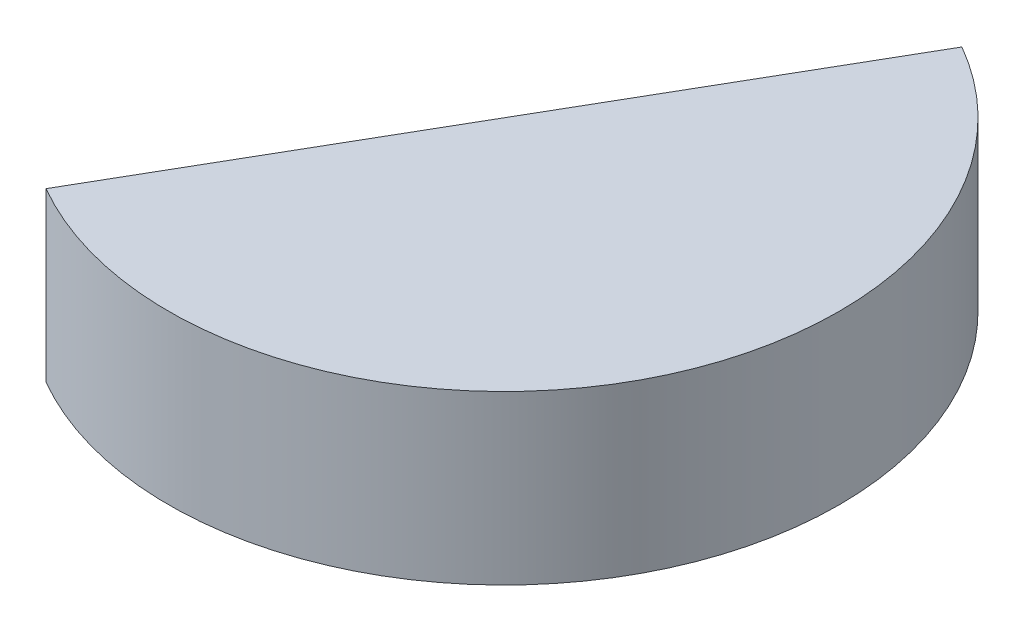
ISO-10303-21;
HEADER;
FILE_DESCRIPTION(('STEP AP214'),'2;1');
FILE_NAME('part.step','',(''),(''),'','','');
FILE_SCHEMA(('AUTOMOTIVE_DESIGN { 1 0 10303 214 1 1 1 1 }'));
ENDSEC;
DATA;
#1=APPLICATION_CONTEXT('core data for automotive mechanical design processes');
#2=APPLICATION_PROTOCOL_DEFINITION('international standard','automotive_design',2000,#1);
#3=PRODUCT_CONTEXT('',#1,'mechanical');
#4=PRODUCT('Part','Part','',(#3));
#5=PRODUCT_RELATED_PRODUCT_CATEGORY('part','',(#4));
#6=PRODUCT_DEFINITION_FORMATION('','',#4);
#7=PRODUCT_DEFINITION_CONTEXT('part definition',#1,'design');
#8=PRODUCT_DEFINITION('design','',#6,#7);
#9=PRODUCT_DEFINITION_SHAPE('','',#8);
#10=(LENGTH_UNIT() NAMED_UNIT(*) SI_UNIT(.MILLI.,.METRE.));
#11=(NAMED_UNIT(*) PLANE_ANGLE_UNIT() SI_UNIT($,.RADIAN.));
#12=(NAMED_UNIT(*) SI_UNIT($,.STERADIAN.) SOLID_ANGLE_UNIT());
#13=UNCERTAINTY_MEASURE_WITH_UNIT(LENGTH_MEASURE(1.E-05),#10,'distance_accuracy_value','');
#14=(GEOMETRIC_REPRESENTATION_CONTEXT(3) GLOBAL_UNCERTAINTY_ASSIGNED_CONTEXT((#13)) GLOBAL_UNIT_ASSIGNED_CONTEXT((#10,
#11,#12)) REPRESENTATION_CONTEXT('',''));
#15=CARTESIAN_POINT('',(0.,0.,0.));
#16=DIRECTION('',(0.,0.,1.));
#17=DIRECTION('',(1.,0.,0.));
#18=AXIS2_PLACEMENT_3D('',#15,#16,#17);
#19=CARTESIAN_POINT('',(0.,5000.,0.));
#20=DIRECTION('',(0.,1.,0.));
#21=DIRECTION('',(0.,0.,1.));
#22=AXIS2_PLACEMENT_3D('',#19,#20,#21);
#23=PLANE('',#22);
#24=DIRECTION('',(-0.499999999999989,0.,0.866025403784445));
#25=VECTOR('',#24,1.);
#26=CARTESIAN_POINT('',(0.,5000.,0.));
#27=LINE('',#26,#25);
#28=CARTESIAN_POINT('',(4999.99999999989,5000.,-8660.25403784445));
#29=VERTEX_POINT('',#28);
#30=CARTESIAN_POINT('',(-5000.00000000009,5000.,8660.25403784434));
#31=VERTEX_POINT('',#30);
#32=EDGE_CURVE('E80',#29,#31,#27,.T.);
#33=ORIENTED_EDGE('',*,*,#32,.T.);
#34=CARTESIAN_POINT('',(0.,5000.,0.));
#35=DIRECTION('',(0.,-1.,0.));
#36=DIRECTION('',(0.,0.,-1.));
#37=AXIS2_PLACEMENT_3D('',#34,#35,#36);
#38=CIRCLE('',#37,10000.);
#39=EDGE_CURVE('E11',#29,#31,#38,.T.);
#40=ORIENTED_EDGE('',*,*,#39,.F.);
#41=EDGE_LOOP('',(#33,#40));
#42=FACE_BOUND('',#41,.T.);
#43=ADVANCED_FACE('F38',(#42),#23,.T.);
#44=CARTESIAN_POINT('',(0.,0.,0.));
#45=DIRECTION('',(0.,-1.,0.));
#46=DIRECTION('',(0.,0.,-1.));
#47=AXIS2_PLACEMENT_3D('',#44,#45,#46);
#48=CYLINDRICAL_SURFACE('',#47,10000.);
#49=DIRECTION('',(0.,-1.,0.));
#50=VECTOR('',#49,1.);
#51=CARTESIAN_POINT('',(-5000.00000000009,0.,8660.25403784434));
#52=LINE('',#51,#50);
#53=CARTESIAN_POINT('',(-5000.00000000009,0.,8660.25403784434));
#54=VERTEX_POINT('',#53);
#55=EDGE_CURVE('E70',#54,#31,#52,.F.);
#56=ORIENTED_EDGE('',*,*,#55,.F.);
#57=CARTESIAN_POINT('',(0.,0.,0.));
#58=DIRECTION('',(0.,-1.,0.));
#59=DIRECTION('',(0.,0.,-1.));
#60=AXIS2_PLACEMENT_3D('',#57,#58,#59);
#61=CIRCLE('',#60,10000.);
#62=CARTESIAN_POINT('',(4999.99999999989,0.,-8660.25403784445));
#63=VERTEX_POINT('',#62);
#64=EDGE_CURVE('E47',#63,#54,#61,.T.);
#65=ORIENTED_EDGE('',*,*,#64,.F.);
#66=DIRECTION('',(0.,1.,0.));
#67=VECTOR('',#66,1.);
#68=CARTESIAN_POINT('',(4999.99999999989,0.,-8660.25403784445));
#69=LINE('',#68,#67);
#70=EDGE_CURVE('E71',#63,#29,#69,.T.);
#71=ORIENTED_EDGE('',*,*,#70,.T.);
#72=ORIENTED_EDGE('',*,*,#39,.T.);
#73=EDGE_LOOP('',(#56,#65,#71,#72));
#74=FACE_BOUND('',#73,.T.);
#75=ADVANCED_FACE('F75',(#74),#48,.T.);
#76=CARTESIAN_POINT('',(0.,0.,0.));
#77=DIRECTION('',(0.,-1.,0.));
#78=DIRECTION('',(0.,0.,-1.));
#79=AXIS2_PLACEMENT_3D('',#76,#77,#78);
#80=PLANE('',#79);
#81=ORIENTED_EDGE('',*,*,#64,.T.);
#82=DIRECTION('',(0.499999999999989,0.,-0.866025403784445));
#83=VECTOR('',#82,1.);
#84=CARTESIAN_POINT('',(0.,0.,0.));
#85=LINE('',#84,#83);
#86=EDGE_CURVE('E67',#54,#63,#85,.T.);
#87=ORIENTED_EDGE('',*,*,#86,.T.);
#88=EDGE_LOOP('',(#81,#87));
#89=FACE_BOUND('',#88,.T.);
#90=ADVANCED_FACE('F78',(#89),#80,.T.);
#91=CARTESIAN_POINT('',(0.,0.,0.));
#92=DIRECTION('',(-0.866025403784445,0.,-0.499999999999989));
#93=DIRECTION('',(-0.499999999999989,0.,0.866025403784445));
#94=AXIS2_PLACEMENT_3D('',#91,#92,#93);
#95=PLANE('',#94);
#96=ORIENTED_EDGE('',*,*,#86,.F.);
#97=ORIENTED_EDGE('',*,*,#55,.T.);
#98=ORIENTED_EDGE('',*,*,#32,.F.);
#99=ORIENTED_EDGE('',*,*,#70,.F.);
#100=EDGE_LOOP('',(#96,#97,#98,#99));
#101=FACE_BOUND('',#100,.T.);
#102=ADVANCED_FACE('F68',(#101),#95,.T.);
#103=CLOSED_SHELL('',(#43,#75,#90,#102));
#104=MANIFOLD_SOLID_BREP('B2',#103);
#105=ADVANCED_BREP_SHAPE_REPRESENTATION('',(#18,#104),#14);
#106=SHAPE_DEFINITION_REPRESENTATION(#9,#105);
ENDSEC;
END-ISO-10303-21;
